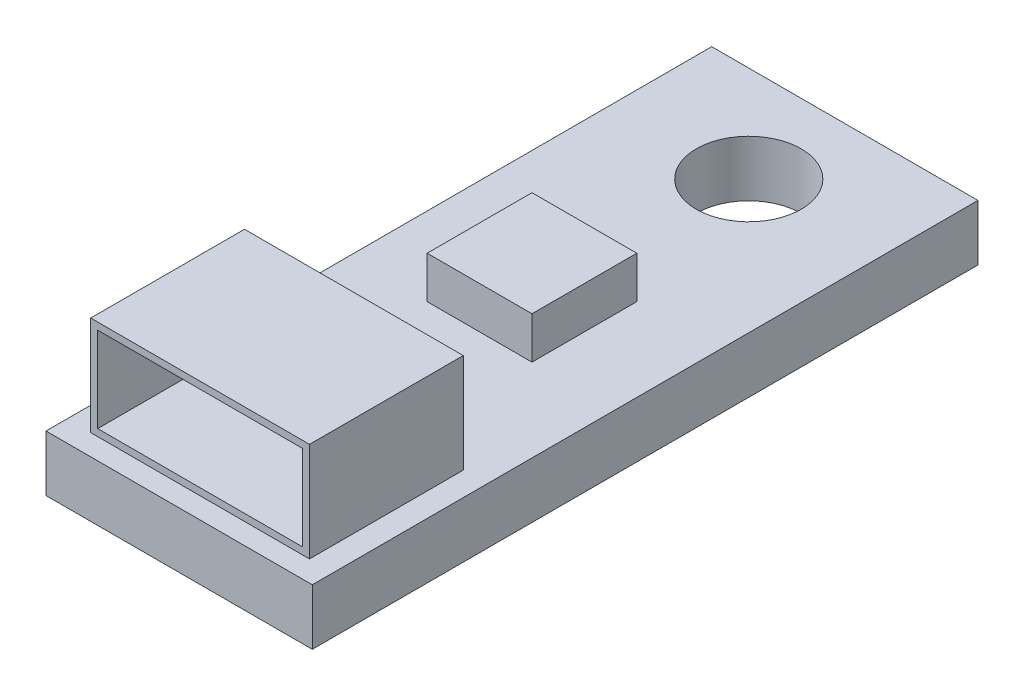
ISO-10303-21;
HEADER;
FILE_DESCRIPTION(('STEP AP214'),'2;1');
FILE_NAME('part.step','',(''),(''),'','','');
FILE_SCHEMA(('AUTOMOTIVE_DESIGN { 1 0 10303 214 1 1 1 1 }'));
ENDSEC;
DATA;
#1=APPLICATION_CONTEXT('core data for automotive mechanical design processes');
#2=APPLICATION_PROTOCOL_DEFINITION('international standard','automotive_design',2000,#1);
#3=PRODUCT_CONTEXT('',#1,'mechanical');
#4=PRODUCT('Part','Part','',(#3));
#5=PRODUCT_RELATED_PRODUCT_CATEGORY('part','',(#4));
#6=PRODUCT_DEFINITION_FORMATION('','',#4);
#7=PRODUCT_DEFINITION_CONTEXT('part definition',#1,'design');
#8=PRODUCT_DEFINITION('design','',#6,#7);
#9=PRODUCT_DEFINITION_SHAPE('','',#8);
#10=(LENGTH_UNIT() NAMED_UNIT(*) SI_UNIT(.MILLI.,.METRE.));
#11=(NAMED_UNIT(*) PLANE_ANGLE_UNIT() SI_UNIT($,.RADIAN.));
#12=(NAMED_UNIT(*) SI_UNIT($,.STERADIAN.) SOLID_ANGLE_UNIT());
#13=UNCERTAINTY_MEASURE_WITH_UNIT(LENGTH_MEASURE(1.E-05),#10,'distance_accuracy_value','');
#14=(GEOMETRIC_REPRESENTATION_CONTEXT(3) GLOBAL_UNCERTAINTY_ASSIGNED_CONTEXT((#13)) GLOBAL_UNIT_ASSIGNED_CONTEXT((#10,
#11,#12)) REPRESENTATION_CONTEXT('',''));
#15=CARTESIAN_POINT('',(0.,0.,0.));
#16=DIRECTION('',(0.,0.,1.));
#17=DIRECTION('',(1.,0.,0.));
#18=AXIS2_PLACEMENT_3D('',#15,#16,#17);
#19=CARTESIAN_POINT('',(0.679999999999999,4.44,-0.6));
#20=DIRECTION('',(1.,0.,0.));
#21=DIRECTION('',(0.,0.,-1.));
#22=AXIS2_PLACEMENT_3D('',#19,#20,#21);
#23=PLANE('',#22);
#24=DIRECTION('',(0.,0.,1.));
#25=VECTOR('',#24,1.);
#26=CARTESIAN_POINT('',(0.679999999999999,1.6,-0.6));
#27=LINE('',#26,#25);
#28=CARTESIAN_POINT('',(0.679999999999999,1.6,-5.));
#29=VERTEX_POINT('',#28);
#30=CARTESIAN_POINT('',(0.679999999999999,1.6,-0.6));
#31=VERTEX_POINT('',#30);
#32=EDGE_CURVE('E166',#29,#31,#27,.T.);
#33=ORIENTED_EDGE('',*,*,#32,.T.);
#34=DIRECTION('',(0.,-1.,0.));
#35=VECTOR('',#34,1.);
#36=CARTESIAN_POINT('',(0.679999999999999,4.44,-0.6));
#37=LINE('',#36,#35);
#38=CARTESIAN_POINT('',(0.679999999999999,4.44,-0.6));
#39=VERTEX_POINT('',#38);
#40=EDGE_CURVE('E13',#39,#31,#37,.T.);
#41=ORIENTED_EDGE('',*,*,#40,.F.);
#42=DIRECTION('',(0.,0.,1.));
#43=VECTOR('',#42,1.);
#44=CARTESIAN_POINT('',(0.679999999999999,4.44,-0.6));
#45=LINE('',#44,#43);
#46=CARTESIAN_POINT('',(0.679999999999999,4.44,-5.));
#47=VERTEX_POINT('',#46);
#48=EDGE_CURVE('E168',#47,#39,#45,.T.);
#49=ORIENTED_EDGE('',*,*,#48,.F.);
#50=DIRECTION('',(0.,-1.,0.));
#51=VECTOR('',#50,1.);
#52=CARTESIAN_POINT('',(0.679999999999999,4.44,-5.));
#53=LINE('',#52,#51);
#54=EDGE_CURVE('E174',#47,#29,#53,.T.);
#55=ORIENTED_EDGE('',*,*,#54,.T.);
#56=EDGE_LOOP('',(#33,#41,#49,#55));
#57=FACE_BOUND('',#56,.T.);
#58=ADVANCED_FACE('F60',(#57),#23,.F.);
#59=CARTESIAN_POINT('',(0.679999999999999,4.44,-0.6));
#60=DIRECTION('',(0.,0.,-1.));
#61=DIRECTION('',(-1.,0.,0.));
#62=AXIS2_PLACEMENT_3D('',#59,#60,#61);
#63=PLANE('',#62);
#64=DIRECTION('',(1.,0.,0.));
#65=VECTOR('',#64,1.);
#66=CARTESIAN_POINT('',(0.879999999999999,1.8,-0.6));
#67=LINE('',#66,#65);
#68=CARTESIAN_POINT('',(0.879999999999999,1.8,-0.6));
#69=VERTEX_POINT('',#68);
#70=CARTESIAN_POINT('',(6.74,1.8,-0.6));
#71=VERTEX_POINT('',#70);
#72=EDGE_CURVE('E149',#69,#71,#67,.T.);
#73=ORIENTED_EDGE('',*,*,#72,.F.);
#74=DIRECTION('',(0.,-1.,0.));
#75=VECTOR('',#74,1.);
#76=CARTESIAN_POINT('',(0.879999999999999,4.24,-0.6));
#77=LINE('',#76,#75);
#78=CARTESIAN_POINT('',(0.879999999999999,4.24,-0.6));
#79=VERTEX_POINT('',#78);
#80=EDGE_CURVE('E74',#79,#69,#77,.T.);
#81=ORIENTED_EDGE('',*,*,#80,.F.);
#82=DIRECTION('',(-1.,0.,0.));
#83=VECTOR('',#82,1.);
#84=CARTESIAN_POINT('',(6.74,4.24,-0.6));
#85=LINE('',#84,#83);
#86=CARTESIAN_POINT('',(6.74,4.24,-0.6));
#87=VERTEX_POINT('',#86);
#88=EDGE_CURVE('E155',#87,#79,#85,.T.);
#89=ORIENTED_EDGE('',*,*,#88,.F.);
#90=DIRECTION('',(0.,1.,0.));
#91=VECTOR('',#90,1.);
#92=CARTESIAN_POINT('',(6.74,1.8,-0.6));
#93=LINE('',#92,#91);
#94=EDGE_CURVE('E139',#71,#87,#93,.T.);
#95=ORIENTED_EDGE('',*,*,#94,.F.);
#96=EDGE_LOOP('',(#73,#81,#89,#95));
#97=FACE_BOUND('',#96,.T.);
#98=DIRECTION('',(1.,0.,0.));
#99=VECTOR('',#98,1.);
#100=CARTESIAN_POINT('',(0.679999999999999,1.6,-0.6));
#101=LINE('',#100,#99);
#102=CARTESIAN_POINT('',(6.94,1.6,-0.6));
#103=VERTEX_POINT('',#102);
#104=EDGE_CURVE('E177',#31,#103,#101,.T.);
#105=ORIENTED_EDGE('',*,*,#104,.T.);
#106=DIRECTION('',(0.,-1.,0.));
#107=VECTOR('',#106,1.);
#108=CARTESIAN_POINT('',(6.94,4.44,-0.6));
#109=LINE('',#108,#107);
#110=CARTESIAN_POINT('',(6.94,4.44,-0.6));
#111=VERTEX_POINT('',#110);
#112=EDGE_CURVE('E67',#111,#103,#109,.T.);
#113=ORIENTED_EDGE('',*,*,#112,.F.);
#114=DIRECTION('',(1.,0.,0.));
#115=VECTOR('',#114,1.);
#116=CARTESIAN_POINT('',(0.679999999999999,4.44,-0.6));
#117=LINE('',#116,#115);
#118=EDGE_CURVE('E111',#39,#111,#117,.T.);
#119=ORIENTED_EDGE('',*,*,#118,.F.);
#120=ORIENTED_EDGE('',*,*,#40,.T.);
#121=EDGE_LOOP('',(#105,#113,#119,#120));
#122=FACE_BOUND('',#121,.T.);
#123=ADVANCED_FACE('F153',(#97,#122),#63,.F.);
#124=CARTESIAN_POINT('',(6.94,4.44,-0.6));
#125=DIRECTION('',(-1.,0.,0.));
#126=DIRECTION('',(0.,0.,1.));
#127=AXIS2_PLACEMENT_3D('',#124,#125,#126);
#128=PLANE('',#127);
#129=DIRECTION('',(0.,0.,-1.));
#130=VECTOR('',#129,1.);
#131=CARTESIAN_POINT('',(6.94,1.6,-0.6));
#132=LINE('',#131,#130);
#133=CARTESIAN_POINT('',(6.94,1.6,-5.));
#134=VERTEX_POINT('',#133);
#135=EDGE_CURVE('E179',#103,#134,#132,.T.);
#136=ORIENTED_EDGE('',*,*,#135,.T.);
#137=DIRECTION('',(0.,-1.,0.));
#138=VECTOR('',#137,1.);
#139=CARTESIAN_POINT('',(6.94,4.44,-5.));
#140=LINE('',#139,#138);
#141=CARTESIAN_POINT('',(6.94,4.44,-5.));
#142=VERTEX_POINT('',#141);
#143=EDGE_CURVE('E183',#142,#134,#140,.T.);
#144=ORIENTED_EDGE('',*,*,#143,.F.);
#145=DIRECTION('',(0.,0.,-1.));
#146=VECTOR('',#145,1.);
#147=CARTESIAN_POINT('',(6.94,4.44,-0.6));
#148=LINE('',#147,#146);
#149=EDGE_CURVE('E171',#111,#142,#148,.T.);
#150=ORIENTED_EDGE('',*,*,#149,.F.);
#151=ORIENTED_EDGE('',*,*,#112,.T.);
#152=EDGE_LOOP('',(#136,#144,#150,#151));
#153=FACE_BOUND('',#152,.T.);
#154=ADVANCED_FACE('F188',(#153),#128,.F.);
#155=CARTESIAN_POINT('',(0.679999999999999,4.44,-5.));
#156=DIRECTION('',(0.,0.,1.));
#157=DIRECTION('',(1.,0.,0.));
#158=AXIS2_PLACEMENT_3D('',#155,#156,#157);
#159=PLANE('',#158);
#160=DIRECTION('',(-1.,0.,0.));
#161=VECTOR('',#160,1.);
#162=CARTESIAN_POINT('',(0.679999999999999,1.6,-5.));
#163=LINE('',#162,#161);
#164=EDGE_CURVE('E104',#134,#29,#163,.T.);
#165=ORIENTED_EDGE('',*,*,#164,.T.);
#166=ORIENTED_EDGE('',*,*,#54,.F.);
#167=DIRECTION('',(-1.,0.,0.));
#168=VECTOR('',#167,1.);
#169=CARTESIAN_POINT('',(0.679999999999999,4.44,-5.));
#170=LINE('',#169,#168);
#171=EDGE_CURVE('E83',#142,#47,#170,.T.);
#172=ORIENTED_EDGE('',*,*,#171,.F.);
#173=ORIENTED_EDGE('',*,*,#143,.T.);
#174=EDGE_LOOP('',(#165,#166,#172,#173));
#175=FACE_BOUND('',#174,.T.);
#176=ADVANCED_FACE('F196',(#175),#159,.F.);
#177=CARTESIAN_POINT('',(0.,4.44,0.));
#178=DIRECTION('',(0.,-1.,0.));
#179=DIRECTION('',(0.,0.,-1.));
#180=AXIS2_PLACEMENT_3D('',#177,#178,#179);
#181=PLANE('',#180);
#182=ORIENTED_EDGE('',*,*,#48,.T.);
#183=ORIENTED_EDGE('',*,*,#118,.T.);
#184=ORIENTED_EDGE('',*,*,#149,.T.);
#185=ORIENTED_EDGE('',*,*,#171,.T.);
#186=EDGE_LOOP('',(#182,#183,#184,#185));
#187=FACE_BOUND('',#186,.T.);
#188=ADVANCED_FACE('F198',(#187),#181,.F.);
#189=CARTESIAN_POINT('',(0.,1.6,0.));
#190=DIRECTION('',(0.,-1.,0.));
#191=DIRECTION('',(0.,0.,-1.));
#192=AXIS2_PLACEMENT_3D('',#189,#190,#191);
#193=PLANE('',#192);
#194=ORIENTED_EDGE('',*,*,#32,.F.);
#195=ORIENTED_EDGE('',*,*,#164,.F.);
#196=ORIENTED_EDGE('',*,*,#135,.F.);
#197=ORIENTED_EDGE('',*,*,#104,.F.);
#198=EDGE_LOOP('',(#194,#195,#196,#197));
#199=FACE_BOUND('',#198,.T.);
#200=ADVANCED_FACE('F192',(#199),#193,.T.);
#201=CARTESIAN_POINT('',(0.879999999999999,4.24,-11.3476924941273));
#202=DIRECTION('',(-1.,0.,0.));
#203=DIRECTION('',(0.,0.,1.));
#204=AXIS2_PLACEMENT_3D('',#201,#202,#203);
#205=PLANE('',#204);
#206=DIRECTION('',(0.,1.,0.));
#207=VECTOR('',#206,1.);
#208=CARTESIAN_POINT('',(0.879999999999999,4.24,-4.8));
#209=LINE('',#208,#207);
#210=CARTESIAN_POINT('',(0.879999999999999,1.8,-4.8));
#211=VERTEX_POINT('',#210);
#212=CARTESIAN_POINT('',(0.879999999999999,4.24,-4.8));
#213=VERTEX_POINT('',#212);
#214=EDGE_CURVE('E167',#211,#213,#209,.T.);
#215=ORIENTED_EDGE('',*,*,#214,.T.);
#216=DIRECTION('',(0.,0.,1.));
#217=VECTOR('',#216,1.);
#218=CARTESIAN_POINT('',(0.879999999999999,4.24,-11.3476924941273));
#219=LINE('',#218,#217);
#220=EDGE_CURVE('E160',#213,#79,#219,.T.);
#221=ORIENTED_EDGE('',*,*,#220,.T.);
#222=ORIENTED_EDGE('',*,*,#80,.T.);
#223=DIRECTION('',(0.,0.,1.));
#224=VECTOR('',#223,1.);
#225=CARTESIAN_POINT('',(0.879999999999999,1.8,-11.3476924941273));
#226=LINE('',#225,#224);
#227=EDGE_CURVE('E146',#211,#69,#226,.T.);
#228=ORIENTED_EDGE('',*,*,#227,.F.);
#229=EDGE_LOOP('',(#215,#221,#222,#228));
#230=FACE_BOUND('',#229,.T.);
#231=ADVANCED_FACE('F221',(#230),#205,.F.);
#232=CARTESIAN_POINT('',(6.74,4.24,-11.3476924941273));
#233=DIRECTION('',(0.,1.,0.));
#234=DIRECTION('',(0.,0.,1.));
#235=AXIS2_PLACEMENT_3D('',#232,#233,#234);
#236=PLANE('',#235);
#237=DIRECTION('',(1.,0.,0.));
#238=VECTOR('',#237,1.);
#239=CARTESIAN_POINT('',(6.74,4.24,-4.8));
#240=LINE('',#239,#238);
#241=CARTESIAN_POINT('',(6.74,4.24,-4.8));
#242=VERTEX_POINT('',#241);
#243=EDGE_CURVE('E291',#213,#242,#240,.T.);
#244=ORIENTED_EDGE('',*,*,#243,.T.);
#245=DIRECTION('',(0.,0.,1.));
#246=VECTOR('',#245,1.);
#247=CARTESIAN_POINT('',(6.74,4.24,-11.3476924941273));
#248=LINE('',#247,#246);
#249=EDGE_CURVE('E145',#242,#87,#248,.T.);
#250=ORIENTED_EDGE('',*,*,#249,.T.);
#251=ORIENTED_EDGE('',*,*,#88,.T.);
#252=ORIENTED_EDGE('',*,*,#220,.F.);
#253=EDGE_LOOP('',(#244,#250,#251,#252));
#254=FACE_BOUND('',#253,.T.);
#255=ADVANCED_FACE('F225',(#254),#236,.F.);
#256=CARTESIAN_POINT('',(6.74,1.8,-11.3476924941273));
#257=DIRECTION('',(1.,0.,0.));
#258=DIRECTION('',(0.,0.,-1.));
#259=AXIS2_PLACEMENT_3D('',#256,#257,#258);
#260=PLANE('',#259);
#261=DIRECTION('',(0.,-1.,0.));
#262=VECTOR('',#261,1.);
#263=CARTESIAN_POINT('',(6.74,1.8,-4.8));
#264=LINE('',#263,#262);
#265=CARTESIAN_POINT('',(6.74,1.8,-4.8));
#266=VERTEX_POINT('',#265);
#267=EDGE_CURVE('E142',#242,#266,#264,.T.);
#268=ORIENTED_EDGE('',*,*,#267,.T.);
#269=DIRECTION('',(0.,0.,1.));
#270=VECTOR('',#269,1.);
#271=CARTESIAN_POINT('',(6.74,1.8,-11.3476924941273));
#272=LINE('',#271,#270);
#273=EDGE_CURVE('E134',#266,#71,#272,.T.);
#274=ORIENTED_EDGE('',*,*,#273,.T.);
#275=ORIENTED_EDGE('',*,*,#94,.T.);
#276=ORIENTED_EDGE('',*,*,#249,.F.);
#277=EDGE_LOOP('',(#268,#274,#275,#276));
#278=FACE_BOUND('',#277,.T.);
#279=ADVANCED_FACE('F136',(#278),#260,.F.);
#280=CARTESIAN_POINT('',(0.879999999999999,1.8,-11.3476924941273));
#281=DIRECTION('',(0.,-1.,0.));
#282=DIRECTION('',(0.,0.,-1.));
#283=AXIS2_PLACEMENT_3D('',#280,#281,#282);
#284=PLANE('',#283);
#285=DIRECTION('',(-1.,0.,0.));
#286=VECTOR('',#285,1.);
#287=CARTESIAN_POINT('',(0.879999999999999,1.8,-4.8));
#288=LINE('',#287,#286);
#289=EDGE_CURVE('E164',#266,#211,#288,.T.);
#290=ORIENTED_EDGE('',*,*,#289,.T.);
#291=ORIENTED_EDGE('',*,*,#227,.T.);
#292=ORIENTED_EDGE('',*,*,#72,.T.);
#293=ORIENTED_EDGE('',*,*,#273,.F.);
#294=EDGE_LOOP('',(#290,#291,#292,#293));
#295=FACE_BOUND('',#294,.T.);
#296=ADVANCED_FACE('F150',(#295),#284,.F.);
#297=CARTESIAN_POINT('',(0.679999999999999,4.44,-4.8));
#298=DIRECTION('',(0.,0.,1.));
#299=DIRECTION('',(1.,0.,0.));
#300=AXIS2_PLACEMENT_3D('',#297,#298,#299);
#301=PLANE('',#300);
#302=ORIENTED_EDGE('',*,*,#214,.F.);
#303=ORIENTED_EDGE('',*,*,#289,.F.);
#304=ORIENTED_EDGE('',*,*,#267,.F.);
#305=ORIENTED_EDGE('',*,*,#243,.F.);
#306=EDGE_LOOP('',(#302,#303,#304,#305));
#307=FACE_BOUND('',#306,.T.);
#308=ADVANCED_FACE('F248',(#307),#301,.T.);
#309=CLOSED_SHELL('',(#58,#123,#154,#176,#188,#200,#231,#255,#279,#296,#308));
#310=MANIFOLD_SOLID_BREP('B2',#309);
#311=CARTESIAN_POINT('',(2.24666236347185,2.8,-11.66));
#312=DIRECTION('',(1.,0.,0.));
#313=DIRECTION('',(0.,0.,-1.));
#314=AXIS2_PLACEMENT_3D('',#311,#312,#313);
#315=PLANE('',#314);
#316=DIRECTION('',(0.,0.,1.));
#317=VECTOR('',#316,1.);
#318=CARTESIAN_POINT('',(2.24666236347185,1.6,-11.66));
#319=LINE('',#318,#317);
#320=CARTESIAN_POINT('',(2.24666236347185,1.6,-11.66));
#321=VERTEX_POINT('',#320);
#322=CARTESIAN_POINT('',(2.24666236347185,1.6,-8.66));
#323=VERTEX_POINT('',#322);
#324=EDGE_CURVE('E371',#321,#323,#319,.T.);
#325=ORIENTED_EDGE('',*,*,#324,.T.);
#326=DIRECTION('',(0.,-1.,0.));
#327=VECTOR('',#326,1.);
#328=CARTESIAN_POINT('',(2.24666236347185,2.8,-8.66));
#329=LINE('',#328,#327);
#330=CARTESIAN_POINT('',(2.24666236347185,2.8,-8.66));
#331=VERTEX_POINT('',#330);
#332=EDGE_CURVE('E58',#331,#323,#329,.T.);
#333=ORIENTED_EDGE('',*,*,#332,.F.);
#334=DIRECTION('',(0.,0.,1.));
#335=VECTOR('',#334,1.);
#336=CARTESIAN_POINT('',(2.24666236347185,2.8,-11.66));
#337=LINE('',#336,#335);
#338=CARTESIAN_POINT('',(2.24666236347185,2.8,-11.66));
#339=VERTEX_POINT('',#338);
#340=EDGE_CURVE('E359',#339,#331,#337,.T.);
#341=ORIENTED_EDGE('',*,*,#340,.F.);
#342=DIRECTION('',(0.,-1.,0.));
#343=VECTOR('',#342,1.);
#344=CARTESIAN_POINT('',(2.24666236347185,2.8,-11.66));
#345=LINE('',#344,#343);
#346=EDGE_CURVE('E367',#339,#321,#345,.T.);
#347=ORIENTED_EDGE('',*,*,#346,.T.);
#348=EDGE_LOOP('',(#325,#333,#341,#347));
#349=FACE_BOUND('',#348,.T.);
#350=ADVANCED_FACE('F308',(#349),#315,.F.);
#351=CARTESIAN_POINT('',(2.24666236347185,2.8,-8.66));
#352=DIRECTION('',(0.,0.,-1.));
#353=DIRECTION('',(-1.,0.,0.));
#354=AXIS2_PLACEMENT_3D('',#351,#352,#353);
#355=PLANE('',#354);
#356=DIRECTION('',(1.,0.,0.));
#357=VECTOR('',#356,1.);
#358=CARTESIAN_POINT('',(2.24666236347185,1.6,-8.66));
#359=LINE('',#358,#357);
#360=CARTESIAN_POINT('',(5.24666236347185,1.6,-8.66));
#361=VERTEX_POINT('',#360);
#362=EDGE_CURVE('E363',#323,#361,#359,.T.);
#363=ORIENTED_EDGE('',*,*,#362,.T.);
#364=DIRECTION('',(0.,-1.,0.));
#365=VECTOR('',#364,1.);
#366=CARTESIAN_POINT('',(5.24666236347185,2.8,-8.66));
#367=LINE('',#366,#365);
#368=CARTESIAN_POINT('',(5.24666236347185,2.8,-8.66));
#369=VERTEX_POINT('',#368);
#370=EDGE_CURVE('E316',#369,#361,#367,.T.);
#371=ORIENTED_EDGE('',*,*,#370,.F.);
#372=DIRECTION('',(1.,0.,0.));
#373=VECTOR('',#372,1.);
#374=CARTESIAN_POINT('',(2.24666236347185,2.8,-8.66));
#375=LINE('',#374,#373);
#376=EDGE_CURVE('E354',#331,#369,#375,.T.);
#377=ORIENTED_EDGE('',*,*,#376,.F.);
#378=ORIENTED_EDGE('',*,*,#332,.T.);
#379=EDGE_LOOP('',(#363,#371,#377,#378));
#380=FACE_BOUND('',#379,.T.);
#381=ADVANCED_FACE('F362',(#380),#355,.F.);
#382=CARTESIAN_POINT('',(5.24666236347185,2.8,-11.66));
#383=DIRECTION('',(-1.,0.,0.));
#384=DIRECTION('',(0.,0.,1.));
#385=AXIS2_PLACEMENT_3D('',#382,#383,#384);
#386=PLANE('',#385);
#387=DIRECTION('',(0.,0.,-1.));
#388=VECTOR('',#387,1.);
#389=CARTESIAN_POINT('',(5.24666236347185,1.6,-11.66));
#390=LINE('',#389,#388);
#391=CARTESIAN_POINT('',(5.24666236347185,1.6,-11.66));
#392=VERTEX_POINT('',#391);
#393=EDGE_CURVE('E341',#361,#392,#390,.T.);
#394=ORIENTED_EDGE('',*,*,#393,.T.);
#395=DIRECTION('',(0.,-1.,0.));
#396=VECTOR('',#395,1.);
#397=CARTESIAN_POINT('',(5.24666236347185,2.8,-11.66));
#398=LINE('',#397,#396);
#399=CARTESIAN_POINT('',(5.24666236347185,2.8,-11.66));
#400=VERTEX_POINT('',#399);
#401=EDGE_CURVE('E364',#400,#392,#398,.T.);
#402=ORIENTED_EDGE('',*,*,#401,.F.);
#403=DIRECTION('',(0.,0.,-1.));
#404=VECTOR('',#403,1.);
#405=CARTESIAN_POINT('',(5.24666236347185,2.8,-11.66));
#406=LINE('',#405,#404);
#407=EDGE_CURVE('E357',#369,#400,#406,.T.);
#408=ORIENTED_EDGE('',*,*,#407,.F.);
#409=ORIENTED_EDGE('',*,*,#370,.T.);
#410=EDGE_LOOP('',(#394,#402,#408,#409));
#411=FACE_BOUND('',#410,.T.);
#412=ADVANCED_FACE('F365',(#411),#386,.F.);
#413=CARTESIAN_POINT('',(2.24666236347185,2.8,-11.66));
#414=DIRECTION('',(0.,0.,1.));
#415=DIRECTION('',(1.,0.,0.));
#416=AXIS2_PLACEMENT_3D('',#413,#414,#415);
#417=PLANE('',#416);
#418=DIRECTION('',(-1.,0.,0.));
#419=VECTOR('',#418,1.);
#420=CARTESIAN_POINT('',(2.24666236347185,1.6,-11.66));
#421=LINE('',#420,#419);
#422=EDGE_CURVE('E347',#392,#321,#421,.T.);
#423=ORIENTED_EDGE('',*,*,#422,.T.);
#424=ORIENTED_EDGE('',*,*,#346,.F.);
#425=DIRECTION('',(-1.,0.,0.));
#426=VECTOR('',#425,1.);
#427=CARTESIAN_POINT('',(2.24666236347185,2.8,-11.66));
#428=LINE('',#427,#426);
#429=EDGE_CURVE('E324',#400,#339,#428,.T.);
#430=ORIENTED_EDGE('',*,*,#429,.F.);
#431=ORIENTED_EDGE('',*,*,#401,.T.);
#432=EDGE_LOOP('',(#423,#424,#430,#431));
#433=FACE_BOUND('',#432,.T.);
#434=ADVANCED_FACE('F378',(#433),#417,.F.);
#435=CARTESIAN_POINT('',(0.,2.8,0.));
#436=DIRECTION('',(0.,1.,0.));
#437=DIRECTION('',(0.,0.,1.));
#438=AXIS2_PLACEMENT_3D('',#435,#436,#437);
#439=PLANE('',#438);
#440=ORIENTED_EDGE('',*,*,#340,.T.);
#441=ORIENTED_EDGE('',*,*,#376,.T.);
#442=ORIENTED_EDGE('',*,*,#407,.T.);
#443=ORIENTED_EDGE('',*,*,#429,.T.);
#444=EDGE_LOOP('',(#440,#441,#442,#443));
#445=FACE_BOUND('',#444,.T.);
#446=ADVANCED_FACE('F355',(#445),#439,.T.);
#447=CARTESIAN_POINT('',(0.,1.6,0.));
#448=DIRECTION('',(0.,1.,0.));
#449=DIRECTION('',(0.,0.,1.));
#450=AXIS2_PLACEMENT_3D('',#447,#448,#449);
#451=PLANE('',#450);
#452=ORIENTED_EDGE('',*,*,#324,.F.);
#453=ORIENTED_EDGE('',*,*,#422,.F.);
#454=ORIENTED_EDGE('',*,*,#393,.F.);
#455=ORIENTED_EDGE('',*,*,#362,.F.);
#456=EDGE_LOOP('',(#452,#453,#454,#455));
#457=FACE_BOUND('',#456,.T.);
#458=ADVANCED_FACE('F381',(#457),#451,.F.);
#459=CLOSED_SHELL('',(#350,#381,#412,#434,#446,#458));
#460=MANIFOLD_SOLID_BREP('B7',#459);
#461=CARTESIAN_POINT('',(0.,1.6,0.));
#462=DIRECTION('',(0.,-1.,0.));
#463=DIRECTION('',(0.,0.,-1.));
#464=AXIS2_PLACEMENT_3D('',#461,#462,#463);
#465=PLANE('',#464);
#466=DIRECTION('',(0.,0.,1.));
#467=VECTOR('',#466,1.);
#468=CARTESIAN_POINT('',(0.,1.6,0.));
#469=LINE('',#468,#467);
#470=CARTESIAN_POINT('',(0.,1.6,-19.05));
#471=VERTEX_POINT('',#470);
#472=CARTESIAN_POINT('',(0.,1.6,0.));
#473=VERTEX_POINT('',#472);
#474=EDGE_CURVE('E485',#471,#473,#469,.T.);
#475=ORIENTED_EDGE('',*,*,#474,.T.);
#476=DIRECTION('',(1.,0.,0.));
#477=VECTOR('',#476,1.);
#478=CARTESIAN_POINT('',(0.,1.6,0.));
#479=LINE('',#478,#477);
#480=CARTESIAN_POINT('',(7.62,1.6,0.));
#481=VERTEX_POINT('',#480);
#482=EDGE_CURVE('E480',#473,#481,#479,.T.);
#483=ORIENTED_EDGE('',*,*,#482,.T.);
#484=DIRECTION('',(0.,0.,-1.));
#485=VECTOR('',#484,1.);
#486=CARTESIAN_POINT('',(7.62,1.6,0.));
#487=LINE('',#486,#485);
#488=CARTESIAN_POINT('',(7.62,1.6,-19.05));
#489=VERTEX_POINT('',#488);
#490=EDGE_CURVE('E483',#481,#489,#487,.T.);
#491=ORIENTED_EDGE('',*,*,#490,.T.);
#492=DIRECTION('',(-1.,0.,0.));
#493=VECTOR('',#492,1.);
#494=CARTESIAN_POINT('',(0.,1.6,-19.05));
#495=LINE('',#494,#493);
#496=EDGE_CURVE('E450',#489,#471,#495,.T.);
#497=ORIENTED_EDGE('',*,*,#496,.T.);
#498=EDGE_LOOP('',(#475,#483,#491,#497));
#499=FACE_BOUND('',#498,.T.);
#500=CARTESIAN_POINT('',(3.81,1.6,-16.3));
#501=DIRECTION('',(0.,1.,0.));
#502=DIRECTION('',(0.,0.,1.));
#503=AXIS2_PLACEMENT_3D('',#500,#501,#502);
#504=CIRCLE('',#503,1.5);
#505=CARTESIAN_POINT('',(3.81,1.6,-14.8));
#506=VERTEX_POINT('',#505);
#507=EDGE_CURVE('E505',#506,#506,#504,.T.);
#508=ORIENTED_EDGE('',*,*,#507,.F.);
#509=EDGE_LOOP('',(#508));
#510=FACE_BOUND('',#509,.T.);
#511=ADVANCED_FACE('F432',(#499,#510),#465,.F.);
#512=CARTESIAN_POINT('',(0.,0.,0.));
#513=DIRECTION('',(0.,-1.,0.));
#514=DIRECTION('',(0.,0.,-1.));
#515=AXIS2_PLACEMENT_3D('',#512,#513,#514);
#516=PLANE('',#515);
#517=DIRECTION('',(0.,0.,1.));
#518=VECTOR('',#517,1.);
#519=CARTESIAN_POINT('',(0.,0.,0.));
#520=LINE('',#519,#518);
#521=CARTESIAN_POINT('',(0.,0.,-19.05));
#522=VERTEX_POINT('',#521);
#523=CARTESIAN_POINT('',(0.,0.,0.));
#524=VERTEX_POINT('',#523);
#525=EDGE_CURVE('E501',#522,#524,#520,.T.);
#526=ORIENTED_EDGE('',*,*,#525,.F.);
#527=DIRECTION('',(-1.,0.,0.));
#528=VECTOR('',#527,1.);
#529=CARTESIAN_POINT('',(0.,0.,-19.05));
#530=LINE('',#529,#528);
#531=CARTESIAN_POINT('',(7.62,0.,-19.05));
#532=VERTEX_POINT('',#531);
#533=EDGE_CURVE('E473',#532,#522,#530,.T.);
#534=ORIENTED_EDGE('',*,*,#533,.F.);
#535=DIRECTION('',(0.,0.,-1.));
#536=VECTOR('',#535,1.);
#537=CARTESIAN_POINT('',(7.62,0.,0.));
#538=LINE('',#537,#536);
#539=CARTESIAN_POINT('',(7.62,0.,0.));
#540=VERTEX_POINT('',#539);
#541=EDGE_CURVE('E467',#540,#532,#538,.T.);
#542=ORIENTED_EDGE('',*,*,#541,.F.);
#543=DIRECTION('',(1.,0.,0.));
#544=VECTOR('',#543,1.);
#545=CARTESIAN_POINT('',(0.,0.,0.));
#546=LINE('',#545,#544);
#547=EDGE_CURVE('E490',#524,#540,#546,.T.);
#548=ORIENTED_EDGE('',*,*,#547,.F.);
#549=EDGE_LOOP('',(#526,#534,#542,#548));
#550=FACE_BOUND('',#549,.T.);
#551=CARTESIAN_POINT('',(3.81,0.,-16.3));
#552=DIRECTION('',(0.,1.,0.));
#553=DIRECTION('',(0.,0.,1.));
#554=AXIS2_PLACEMENT_3D('',#551,#552,#553);
#555=CIRCLE('',#554,1.5);
#556=CARTESIAN_POINT('',(3.81,0.,-14.8));
#557=VERTEX_POINT('',#556);
#558=EDGE_CURVE('E523',#557,#557,#555,.T.);
#559=ORIENTED_EDGE('',*,*,#558,.T.);
#560=EDGE_LOOP('',(#559));
#561=FACE_BOUND('',#560,.T.);
#562=ADVANCED_FACE('F518',(#550,#561),#516,.T.);
#563=CARTESIAN_POINT('',(0.,1.6,0.));
#564=DIRECTION('',(1.,0.,0.));
#565=DIRECTION('',(0.,0.,-1.));
#566=AXIS2_PLACEMENT_3D('',#563,#564,#565);
#567=PLANE('',#566);
#568=ORIENTED_EDGE('',*,*,#525,.T.);
#569=DIRECTION('',(0.,-1.,0.));
#570=VECTOR('',#569,1.);
#571=CARTESIAN_POINT('',(0.,1.6,0.));
#572=LINE('',#571,#570);
#573=EDGE_CURVE('E306',#473,#524,#572,.T.);
#574=ORIENTED_EDGE('',*,*,#573,.F.);
#575=ORIENTED_EDGE('',*,*,#474,.F.);
#576=DIRECTION('',(0.,-1.,0.));
#577=VECTOR('',#576,1.);
#578=CARTESIAN_POINT('',(0.,1.6,-19.05));
#579=LINE('',#578,#577);
#580=EDGE_CURVE('E497',#471,#522,#579,.T.);
#581=ORIENTED_EDGE('',*,*,#580,.T.);
#582=EDGE_LOOP('',(#568,#574,#575,#581));
#583=FACE_BOUND('',#582,.T.);
#584=ADVANCED_FACE('F434',(#583),#567,.F.);
#585=CARTESIAN_POINT('',(0.,1.6,0.));
#586=DIRECTION('',(0.,0.,-1.));
#587=DIRECTION('',(-1.,0.,0.));
#588=AXIS2_PLACEMENT_3D('',#585,#586,#587);
#589=PLANE('',#588);
#590=ORIENTED_EDGE('',*,*,#547,.T.);
#591=DIRECTION('',(0.,-1.,0.));
#592=VECTOR('',#591,1.);
#593=CARTESIAN_POINT('',(7.62,1.6,0.));
#594=LINE('',#593,#592);
#595=EDGE_CURVE('E442',#481,#540,#594,.T.);
#596=ORIENTED_EDGE('',*,*,#595,.F.);
#597=ORIENTED_EDGE('',*,*,#482,.F.);
#598=ORIENTED_EDGE('',*,*,#573,.T.);
#599=EDGE_LOOP('',(#590,#596,#597,#598));
#600=FACE_BOUND('',#599,.T.);
#601=ADVANCED_FACE('F489',(#600),#589,.F.);
#602=CARTESIAN_POINT('',(7.62,1.6,0.));
#603=DIRECTION('',(-1.,0.,0.));
#604=DIRECTION('',(0.,0.,1.));
#605=AXIS2_PLACEMENT_3D('',#602,#603,#604);
#606=PLANE('',#605);
#607=ORIENTED_EDGE('',*,*,#541,.T.);
#608=DIRECTION('',(0.,-1.,0.));
#609=VECTOR('',#608,1.);
#610=CARTESIAN_POINT('',(7.62,1.6,-19.05));
#611=LINE('',#610,#609);
#612=EDGE_CURVE('E492',#489,#532,#611,.T.);
#613=ORIENTED_EDGE('',*,*,#612,.F.);
#614=ORIENTED_EDGE('',*,*,#490,.F.);
#615=ORIENTED_EDGE('',*,*,#595,.T.);
#616=EDGE_LOOP('',(#607,#613,#614,#615));
#617=FACE_BOUND('',#616,.T.);
#618=ADVANCED_FACE('F493',(#617),#606,.F.);
#619=CARTESIAN_POINT('',(0.,1.6,-19.05));
#620=DIRECTION('',(0.,0.,1.));
#621=DIRECTION('',(1.,0.,0.));
#622=AXIS2_PLACEMENT_3D('',#619,#620,#621);
#623=PLANE('',#622);
#624=ORIENTED_EDGE('',*,*,#533,.T.);
#625=ORIENTED_EDGE('',*,*,#580,.F.);
#626=ORIENTED_EDGE('',*,*,#496,.F.);
#627=ORIENTED_EDGE('',*,*,#612,.T.);
#628=EDGE_LOOP('',(#624,#625,#626,#627));
#629=FACE_BOUND('',#628,.T.);
#630=ADVANCED_FACE('F515',(#629),#623,.F.);
#631=CARTESIAN_POINT('',(3.81,1.6,-16.3));
#632=DIRECTION('',(0.,-1.,0.));
#633=DIRECTION('',(0.,0.,-1.));
#634=AXIS2_PLACEMENT_3D('',#631,#632,#633);
#635=CYLINDRICAL_SURFACE('',#634,1.5);
#636=ORIENTED_EDGE('',*,*,#507,.T.);
#637=EDGE_LOOP('',(#636));
#638=FACE_BOUND('',#637,.T.);
#639=ORIENTED_EDGE('',*,*,#558,.F.);
#640=EDGE_LOOP('',(#639));
#641=FACE_BOUND('',#640,.T.);
#642=ADVANCED_FACE('F531',(#638,#641),#635,.F.);
#643=CLOSED_SHELL('',(#511,#562,#584,#601,#618,#630,#642));
#644=MANIFOLD_SOLID_BREP('B52',#643);
#645=ADVANCED_BREP_SHAPE_REPRESENTATION('',(#18,#310,#460,#644),#14);
#646=SHAPE_DEFINITION_REPRESENTATION(#9,#645);
ENDSEC;
END-ISO-10303-21;
